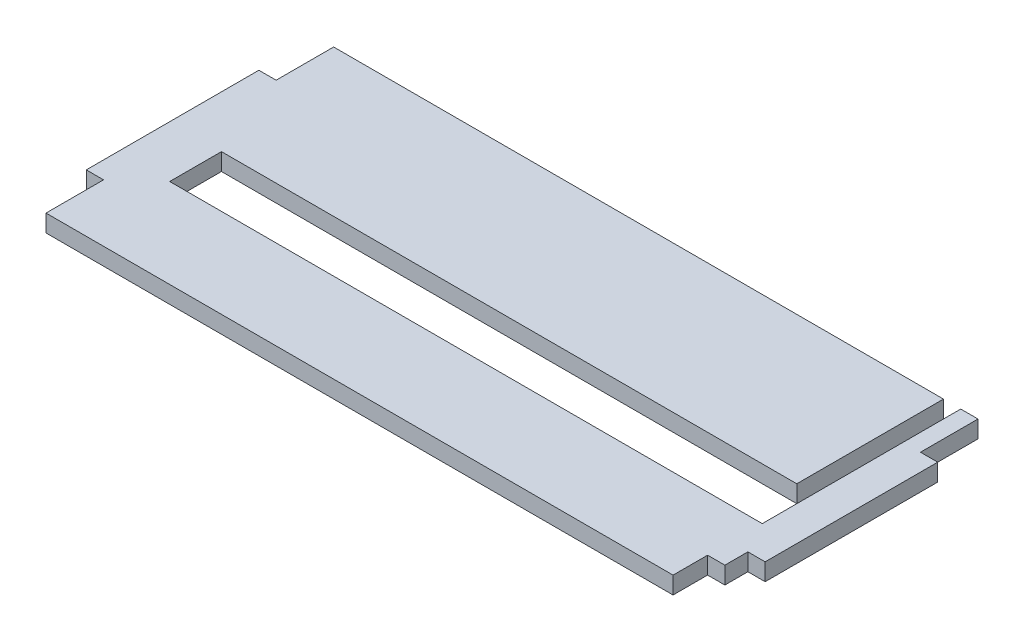
ISO-10303-21;
HEADER;
FILE_DESCRIPTION(('STEP AP214'),'2;1');
FILE_NAME('part.step','',(''),(''),'','','');
FILE_SCHEMA(('AUTOMOTIVE_DESIGN { 1 0 10303 214 1 1 1 1 }'));
ENDSEC;
DATA;
#1=APPLICATION_CONTEXT('core data for automotive mechanical design processes');
#2=APPLICATION_PROTOCOL_DEFINITION('international standard','automotive_design',2000,#1);
#3=PRODUCT_CONTEXT('',#1,'mechanical');
#4=PRODUCT('Part','Part','',(#3));
#5=PRODUCT_RELATED_PRODUCT_CATEGORY('part','',(#4));
#6=PRODUCT_DEFINITION_FORMATION('','',#4);
#7=PRODUCT_DEFINITION_CONTEXT('part definition',#1,'design');
#8=PRODUCT_DEFINITION('design','',#6,#7);
#9=PRODUCT_DEFINITION_SHAPE('','',#8);
#10=(LENGTH_UNIT() NAMED_UNIT(*) SI_UNIT(.MILLI.,.METRE.));
#11=(NAMED_UNIT(*) PLANE_ANGLE_UNIT() SI_UNIT($,.RADIAN.));
#12=(NAMED_UNIT(*) SI_UNIT($,.STERADIAN.) SOLID_ANGLE_UNIT());
#13=UNCERTAINTY_MEASURE_WITH_UNIT(LENGTH_MEASURE(1.E-05),#10,'distance_accuracy_value','');
#14=(GEOMETRIC_REPRESENTATION_CONTEXT(3) GLOBAL_UNCERTAINTY_ASSIGNED_CONTEXT((#13)) GLOBAL_UNIT_ASSIGNED_CONTEXT((#10,
#11,#12)) REPRESENTATION_CONTEXT('',''));
#15=CARTESIAN_POINT('',(0.,0.,0.));
#16=DIRECTION('',(0.,0.,1.));
#17=DIRECTION('',(1.,0.,0.));
#18=AXIS2_PLACEMENT_3D('',#15,#16,#17);
#19=CARTESIAN_POINT('',(0.,0.,99.9999999999988));
#20=DIRECTION('',(0.,0.,-1.));
#21=DIRECTION('',(-1.,0.,0.));
#22=AXIS2_PLACEMENT_3D('',#19,#20,#21);
#23=PLANE('',#22);
#24=DIRECTION('',(0.,1.,0.));
#25=VECTOR('',#24,1.);
#26=CARTESIAN_POINT('',(-9.00000000000162,0.,99.9999999999989));
#27=LINE('',#26,#25);
#28=CARTESIAN_POINT('',(-9.00000000000162,0.,99.9999999999989));
#29=VERTEX_POINT('',#28);
#30=CARTESIAN_POINT('',(-9.00000000000162,3.,99.9999999999989));
#31=VERTEX_POINT('',#30);
#32=EDGE_CURVE('E209',#29,#31,#27,.T.);
#33=ORIENTED_EDGE('',*,*,#32,.F.);
#34=DIRECTION('',(-1.,0.,0.));
#35=VECTOR('',#34,1.);
#36=CARTESIAN_POINT('',(0.,0.,99.9999999999988));
#37=LINE('',#36,#35);
#38=CARTESIAN_POINT('',(-115.000000000005,0.,99.9999999999989));
#39=VERTEX_POINT('',#38);
#40=EDGE_CURVE('E320',#29,#39,#37,.T.);
#41=ORIENTED_EDGE('',*,*,#40,.T.);
#42=DIRECTION('',(0.,1.,0.));
#43=VECTOR('',#42,1.);
#44=CARTESIAN_POINT('',(-115.000000000005,0.,99.9999999999989));
#45=LINE('',#44,#43);
#46=CARTESIAN_POINT('',(-115.000000000005,3.,99.9999999999989));
#47=VERTEX_POINT('',#46);
#48=EDGE_CURVE('E337',#39,#47,#45,.T.);
#49=ORIENTED_EDGE('',*,*,#48,.T.);
#50=DIRECTION('',(-1.,0.,0.));
#51=VECTOR('',#50,1.);
#52=CARTESIAN_POINT('',(-118.000000000002,3.,99.9999999999989));
#53=LINE('',#52,#51);
#54=EDGE_CURVE('E241',#31,#47,#53,.T.);
#55=ORIENTED_EDGE('',*,*,#54,.F.);
#56=EDGE_LOOP('',(#33,#41,#49,#55));
#57=FACE_BOUND('',#56,.T.);
#58=ADVANCED_FACE('F40',(#57),#23,.T.);
#59=CARTESIAN_POINT('',(-1.55431223447522E-12,12.,139.999999999999));
#60=DIRECTION('',(0.,0.,-1.));
#61=DIRECTION('',(-1.,0.,0.));
#62=AXIS2_PLACEMENT_3D('',#59,#60,#61);
#63=PLANE('',#62);
#64=DIRECTION('',(1.,0.,0.));
#65=VECTOR('',#64,1.);
#66=CARTESIAN_POINT('',(-1.55431223447522E-12,3.,139.999999999999));
#67=LINE('',#66,#65);
#68=CARTESIAN_POINT('',(-3.00000000000156,3.,139.999999999999));
#69=VERTEX_POINT('',#68);
#70=CARTESIAN_POINT('',(-1.55431223447522E-12,3.,139.999999999999));
#71=VERTEX_POINT('',#70);
#72=EDGE_CURVE('E257',#69,#71,#67,.T.);
#73=ORIENTED_EDGE('',*,*,#72,.F.);
#74=DIRECTION('',(0.,1.,0.));
#75=VECTOR('',#74,1.);
#76=CARTESIAN_POINT('',(-3.00000000000156,0.,139.999999999999));
#77=LINE('',#76,#75);
#78=CARTESIAN_POINT('',(-3.00000000000156,0.,139.999999999999));
#79=VERTEX_POINT('',#78);
#80=EDGE_CURVE('E321',#79,#69,#77,.T.);
#81=ORIENTED_EDGE('',*,*,#80,.F.);
#82=DIRECTION('',(1.,0.,0.));
#83=VECTOR('',#82,1.);
#84=CARTESIAN_POINT('',(-1.55431223447522E-12,0.,139.999999999999));
#85=LINE('',#84,#83);
#86=CARTESIAN_POINT('',(-1.55431223447522E-12,0.,139.999999999999));
#87=VERTEX_POINT('',#86);
#88=EDGE_CURVE('E342',#79,#87,#85,.T.);
#89=ORIENTED_EDGE('',*,*,#88,.T.);
#90=DIRECTION('',(0.,1.,0.));
#91=VECTOR('',#90,1.);
#92=CARTESIAN_POINT('',(-1.55431223447522E-12,0.,139.999999999999));
#93=LINE('',#92,#91);
#94=EDGE_CURVE('E284',#87,#71,#93,.T.);
#95=ORIENTED_EDGE('',*,*,#94,.T.);
#96=EDGE_LOOP('',(#73,#81,#89,#95));
#97=FACE_BOUND('',#96,.T.);
#98=ADVANCED_FACE('F42',(#97),#63,.F.);
#99=CARTESIAN_POINT('',(-1.60982338570648E-12,12.,109.999999999999));
#100=DIRECTION('',(0.,0.,-1.));
#101=DIRECTION('',(-1.,0.,0.));
#102=AXIS2_PLACEMENT_3D('',#99,#100,#101);
#103=PLANE('',#102);
#104=DIRECTION('',(0.,1.,0.));
#105=VECTOR('',#104,1.);
#106=CARTESIAN_POINT('',(-2.99999999999845,0.,109.999999999999));
#107=LINE('',#106,#105);
#108=CARTESIAN_POINT('',(-2.99999999999845,0.,109.999999999999));
#109=VERTEX_POINT('',#108);
#110=CARTESIAN_POINT('',(-2.99999999999845,3.,109.999999999999));
#111=VERTEX_POINT('',#110);
#112=EDGE_CURVE('E365',#109,#111,#107,.T.);
#113=ORIENTED_EDGE('',*,*,#112,.T.);
#114=DIRECTION('',(1.,0.,0.));
#115=VECTOR('',#114,1.);
#116=CARTESIAN_POINT('',(-1.60982338570648E-12,3.,109.999999999999));
#117=LINE('',#116,#115);
#118=CARTESIAN_POINT('',(-1.55431223447522E-12,3.,109.999999999999));
#119=VERTEX_POINT('',#118);
#120=EDGE_CURVE('E263',#111,#119,#117,.T.);
#121=ORIENTED_EDGE('',*,*,#120,.T.);
#122=DIRECTION('',(0.,1.,0.));
#123=VECTOR('',#122,1.);
#124=CARTESIAN_POINT('',(-3.33066907387547E-13,0.,109.999999999999));
#125=LINE('',#124,#123);
#126=CARTESIAN_POINT('',(-1.55431223447522E-12,0.,109.999999999999));
#127=VERTEX_POINT('',#126);
#128=EDGE_CURVE('E285',#127,#119,#125,.T.);
#129=ORIENTED_EDGE('',*,*,#128,.F.);
#130=DIRECTION('',(1.,0.,0.));
#131=VECTOR('',#130,1.);
#132=CARTESIAN_POINT('',(-1.60982338570648E-12,0.,109.999999999999));
#133=LINE('',#132,#131);
#134=EDGE_CURVE('E375',#109,#127,#133,.T.);
#135=ORIENTED_EDGE('',*,*,#134,.F.);
#136=EDGE_LOOP('',(#113,#121,#129,#135));
#137=FACE_BOUND('',#136,.T.);
#138=ADVANCED_FACE('F443',(#137),#103,.T.);
#139=CARTESIAN_POINT('',(-118.000000000001,12.,109.999999999999));
#140=DIRECTION('',(0.,0.,1.));
#141=DIRECTION('',(1.,0.,0.));
#142=AXIS2_PLACEMENT_3D('',#139,#140,#141);
#143=PLANE('',#142);
#144=DIRECTION('',(-1.,0.,0.));
#145=VECTOR('',#144,1.);
#146=CARTESIAN_POINT('',(-118.000000000001,3.,109.999999999999));
#147=LINE('',#146,#145);
#148=CARTESIAN_POINT('',(-115.000000000005,3.,109.999999999999));
#149=VERTEX_POINT('',#148);
#150=CARTESIAN_POINT('',(-118.000000000002,3.,109.999999999999));
#151=VERTEX_POINT('',#150);
#152=EDGE_CURVE('E271',#149,#151,#147,.T.);
#153=ORIENTED_EDGE('',*,*,#152,.F.);
#154=DIRECTION('',(0.,1.,0.));
#155=VECTOR('',#154,1.);
#156=CARTESIAN_POINT('',(-115.000000000005,0.,109.999999999999));
#157=LINE('',#156,#155);
#158=CARTESIAN_POINT('',(-115.000000000005,0.,109.999999999999));
#159=VERTEX_POINT('',#158);
#160=EDGE_CURVE('E361',#159,#149,#157,.T.);
#161=ORIENTED_EDGE('',*,*,#160,.F.);
#162=DIRECTION('',(-1.,0.,0.));
#163=VECTOR('',#162,1.);
#164=CARTESIAN_POINT('',(-118.000000000001,0.,109.999999999999));
#165=LINE('',#164,#163);
#166=CARTESIAN_POINT('',(-118.000000000001,0.,109.999999999999));
#167=VERTEX_POINT('',#166);
#168=EDGE_CURVE('E379',#159,#167,#165,.T.);
#169=ORIENTED_EDGE('',*,*,#168,.T.);
#170=DIRECTION('',(0.,1.,0.));
#171=VECTOR('',#170,1.);
#172=CARTESIAN_POINT('',(-118.000000000001,0.,109.999999999999));
#173=LINE('',#172,#171);
#174=EDGE_CURVE('E297',#167,#151,#173,.T.);
#175=ORIENTED_EDGE('',*,*,#174,.T.);
#176=EDGE_LOOP('',(#153,#161,#169,#175));
#177=FACE_BOUND('',#176,.T.);
#178=ADVANCED_FACE('F409',(#177),#143,.F.);
#179=CARTESIAN_POINT('',(-118.000000000002,12.,139.999999999999));
#180=DIRECTION('',(0.,0.,1.));
#181=DIRECTION('',(1.,0.,0.));
#182=AXIS2_PLACEMENT_3D('',#179,#180,#181);
#183=PLANE('',#182);
#184=DIRECTION('',(0.,1.,0.));
#185=VECTOR('',#184,1.);
#186=CARTESIAN_POINT('',(-115.000000000002,0.,139.999999999999));
#187=LINE('',#186,#185);
#188=CARTESIAN_POINT('',(-115.000000000002,0.,139.999999999999));
#189=VERTEX_POINT('',#188);
#190=CARTESIAN_POINT('',(-115.000000000002,3.,139.999999999999));
#191=VERTEX_POINT('',#190);
#192=EDGE_CURVE('E336',#189,#191,#187,.T.);
#193=ORIENTED_EDGE('',*,*,#192,.T.);
#194=DIRECTION('',(-1.,0.,0.));
#195=VECTOR('',#194,1.);
#196=CARTESIAN_POINT('',(-118.000000000002,3.,139.999999999999));
#197=LINE('',#196,#195);
#198=CARTESIAN_POINT('',(-118.000000000002,3.,139.999999999999));
#199=VERTEX_POINT('',#198);
#200=EDGE_CURVE('E277',#191,#199,#197,.T.);
#201=ORIENTED_EDGE('',*,*,#200,.T.);
#202=DIRECTION('',(0.,1.,0.));
#203=VECTOR('',#202,1.);
#204=CARTESIAN_POINT('',(-118.000000000002,0.,139.999999999999));
#205=LINE('',#204,#203);
#206=CARTESIAN_POINT('',(-118.000000000001,0.,139.999999999999));
#207=VERTEX_POINT('',#206);
#208=EDGE_CURVE('E296',#207,#199,#205,.T.);
#209=ORIENTED_EDGE('',*,*,#208,.F.);
#210=DIRECTION('',(-1.,0.,0.));
#211=VECTOR('',#210,1.);
#212=CARTESIAN_POINT('',(-118.000000000002,0.,139.999999999999));
#213=LINE('',#212,#211);
#214=EDGE_CURVE('E383',#189,#207,#213,.T.);
#215=ORIENTED_EDGE('',*,*,#214,.F.);
#216=EDGE_LOOP('',(#193,#201,#209,#215));
#217=FACE_BOUND('',#216,.T.);
#218=ADVANCED_FACE('F402',(#217),#183,.T.);
#219=CARTESIAN_POINT('',(-1.60982338570648E-12,12.,149.999999999999));
#220=DIRECTION('',(0.,0.,1.));
#221=DIRECTION('',(1.,0.,0.));
#222=AXIS2_PLACEMENT_3D('',#219,#220,#221);
#223=PLANE('',#222);
#224=DIRECTION('',(0.,1.,0.));
#225=VECTOR('',#224,1.);
#226=CARTESIAN_POINT('',(-6.00197015274362,0.,149.999999999999));
#227=LINE('',#226,#225);
#228=CARTESIAN_POINT('',(-6.00197015274362,0.,149.999999999999));
#229=VERTEX_POINT('',#228);
#230=CARTESIAN_POINT('',(-6.00197015274362,3.,149.999999999999));
#231=VERTEX_POINT('',#230);
#232=EDGE_CURVE('E325',#229,#231,#227,.T.);
#233=ORIENTED_EDGE('',*,*,#232,.T.);
#234=DIRECTION('',(1.,0.,0.));
#235=VECTOR('',#234,1.);
#236=CARTESIAN_POINT('',(-118.000000000002,3.,149.999999999999));
#237=LINE('',#236,#235);
#238=CARTESIAN_POINT('',(-115.000000000002,3.,149.999999999999));
#239=VERTEX_POINT('',#238);
#240=EDGE_CURVE('E238',#239,#231,#237,.T.);
#241=ORIENTED_EDGE('',*,*,#240,.F.);
#242=DIRECTION('',(0.,1.,0.));
#243=VECTOR('',#242,1.);
#244=CARTESIAN_POINT('',(-115.000000000002,0.,149.999999999999));
#245=LINE('',#244,#243);
#246=CARTESIAN_POINT('',(-115.000000000002,0.,149.999999999999));
#247=VERTEX_POINT('',#246);
#248=EDGE_CURVE('E338',#247,#239,#245,.T.);
#249=ORIENTED_EDGE('',*,*,#248,.F.);
#250=DIRECTION('',(-1.,0.,0.));
#251=VECTOR('',#250,1.);
#252=CARTESIAN_POINT('',(-1.60982338570648E-12,0.,149.999999999999));
#253=LINE('',#252,#251);
#254=EDGE_CURVE('E49',#229,#247,#253,.T.);
#255=ORIENTED_EDGE('',*,*,#254,.F.);
#256=EDGE_LOOP('',(#233,#241,#249,#255));
#257=FACE_BOUND('',#256,.T.);
#258=ADVANCED_FACE('F395',(#257),#223,.T.);
#259=CARTESIAN_POINT('',(-115.000000000002,0.,0.));
#260=DIRECTION('',(1.,0.,0.));
#261=DIRECTION('',(0.,0.,-1.));
#262=AXIS2_PLACEMENT_3D('',#259,#260,#261);
#263=PLANE('',#262);
#264=DIRECTION('',(0.,0.,1.));
#265=VECTOR('',#264,1.);
#266=CARTESIAN_POINT('',(-115.000000000002,3.,0.));
#267=LINE('',#266,#265);
#268=EDGE_CURVE('E274',#191,#239,#267,.T.);
#269=ORIENTED_EDGE('',*,*,#268,.F.);
#270=ORIENTED_EDGE('',*,*,#192,.F.);
#271=DIRECTION('',(0.,0.,-1.));
#272=VECTOR('',#271,1.);
#273=CARTESIAN_POINT('',(-115.000000000002,0.,0.));
#274=LINE('',#273,#272);
#275=EDGE_CURVE('E332',#247,#189,#274,.T.);
#276=ORIENTED_EDGE('',*,*,#275,.F.);
#277=ORIENTED_EDGE('',*,*,#248,.T.);
#278=EDGE_LOOP('',(#269,#270,#276,#277));
#279=FACE_BOUND('',#278,.T.);
#280=ADVANCED_FACE('F399',(#279),#263,.F.);
#281=DIRECTION('',(0.,1.,0.));
#282=VECTOR('',#281,1.);
#283=CARTESIAN_POINT('',(-6.00000000000162,0.,99.9999999999989));
#284=LINE('',#283,#282);
#285=CARTESIAN_POINT('',(-6.00000000000162,0.,99.9999999999989));
#286=VERTEX_POINT('',#285);
#287=CARTESIAN_POINT('',(-6.00000000000162,3.,99.9999999999989));
#288=VERTEX_POINT('',#287);
#289=EDGE_CURVE('E198',#286,#288,#284,.T.);
#290=ORIENTED_EDGE('',*,*,#289,.T.);
#291=CARTESIAN_POINT('',(-2.9999999999985,3.,99.9999999999989));
#292=VERTEX_POINT('',#291);
#293=EDGE_CURVE('E242',#292,#288,#53,.T.);
#294=ORIENTED_EDGE('',*,*,#293,.F.);
#295=DIRECTION('',(0.,1.,0.));
#296=VECTOR('',#295,1.);
#297=CARTESIAN_POINT('',(-2.9999999999985,0.,99.9999999999989));
#298=LINE('',#297,#296);
#299=CARTESIAN_POINT('',(-2.9999999999985,0.,99.9999999999989));
#300=VERTEX_POINT('',#299);
#301=EDGE_CURVE('E357',#300,#292,#298,.T.);
#302=ORIENTED_EDGE('',*,*,#301,.F.);
#303=EDGE_CURVE('E346',#300,#286,#37,.T.);
#304=ORIENTED_EDGE('',*,*,#303,.T.);
#305=EDGE_LOOP('',(#290,#294,#302,#304));
#306=FACE_BOUND('',#305,.T.);
#307=ADVANCED_FACE('F439',(#306),#23,.T.);
#308=CARTESIAN_POINT('',(-115.000000000005,0.,0.));
#309=DIRECTION('',(-1.,0.,0.));
#310=DIRECTION('',(0.,0.,1.));
#311=AXIS2_PLACEMENT_3D('',#308,#309,#310);
#312=PLANE('',#311);
#313=ORIENTED_EDGE('',*,*,#160,.T.);
#314=DIRECTION('',(0.,0.,-1.));
#315=VECTOR('',#314,1.);
#316=CARTESIAN_POINT('',(-115.000000000005,3.,0.));
#317=LINE('',#316,#315);
#318=EDGE_CURVE('E267',#149,#47,#317,.T.);
#319=ORIENTED_EDGE('',*,*,#318,.T.);
#320=ORIENTED_EDGE('',*,*,#48,.F.);
#321=DIRECTION('',(0.,0.,1.));
#322=VECTOR('',#321,1.);
#323=CARTESIAN_POINT('',(-115.000000000005,0.,0.));
#324=LINE('',#323,#322);
#325=EDGE_CURVE('E353',#39,#159,#324,.T.);
#326=ORIENTED_EDGE('',*,*,#325,.T.);
#327=EDGE_LOOP('',(#313,#319,#320,#326));
#328=FACE_BOUND('',#327,.T.);
#329=ADVANCED_FACE('F411',(#328),#312,.T.);
#330=CARTESIAN_POINT('',(-2.99999999999845,0.,0.));
#331=DIRECTION('',(-1.,0.,0.));
#332=DIRECTION('',(0.,0.,1.));
#333=AXIS2_PLACEMENT_3D('',#330,#331,#332);
#334=PLANE('',#333);
#335=DIRECTION('',(0.,0.,-1.));
#336=VECTOR('',#335,1.);
#337=CARTESIAN_POINT('',(-2.99999999999845,3.,0.));
#338=LINE('',#337,#336);
#339=EDGE_CURVE('E260',#111,#292,#338,.T.);
#340=ORIENTED_EDGE('',*,*,#339,.F.);
#341=ORIENTED_EDGE('',*,*,#112,.F.);
#342=DIRECTION('',(0.,0.,1.));
#343=VECTOR('',#342,1.);
#344=CARTESIAN_POINT('',(-2.99999999999845,0.,0.));
#345=LINE('',#344,#343);
#346=EDGE_CURVE('E349',#300,#109,#345,.T.);
#347=ORIENTED_EDGE('',*,*,#346,.F.);
#348=ORIENTED_EDGE('',*,*,#301,.T.);
#349=EDGE_LOOP('',(#340,#341,#347,#348));
#350=FACE_BOUND('',#349,.T.);
#351=ADVANCED_FACE('F453',(#350),#334,.F.);
#352=CARTESIAN_POINT('',(0.,0.,143.999999999999));
#353=DIRECTION('',(0.,0.,1.));
#354=DIRECTION('',(1.,0.,0.));
#355=AXIS2_PLACEMENT_3D('',#352,#353,#354);
#356=PLANE('',#355);
#357=DIRECTION('',(0.,1.,0.));
#358=VECTOR('',#357,1.);
#359=CARTESIAN_POINT('',(-3.00000000000156,0.,143.999999999999));
#360=LINE('',#359,#358);
#361=CARTESIAN_POINT('',(-3.00000000000156,0.,143.999999999999));
#362=VERTEX_POINT('',#361);
#363=CARTESIAN_POINT('',(-3.00000000000156,3.,143.999999999999));
#364=VERTEX_POINT('',#363);
#365=EDGE_CURVE('E316',#362,#364,#360,.T.);
#366=ORIENTED_EDGE('',*,*,#365,.T.);
#367=DIRECTION('',(-1.,0.,0.));
#368=VECTOR('',#367,1.);
#369=CARTESIAN_POINT('',(0.,3.,143.999999999999));
#370=LINE('',#369,#368);
#371=CARTESIAN_POINT('',(-6.00197015274351,3.,143.999999999999));
#372=VERTEX_POINT('',#371);
#373=EDGE_CURVE('E249',#364,#372,#370,.T.);
#374=ORIENTED_EDGE('',*,*,#373,.T.);
#375=DIRECTION('',(0.,1.,0.));
#376=VECTOR('',#375,1.);
#377=CARTESIAN_POINT('',(-6.00197015274351,0.,143.999999999999));
#378=LINE('',#377,#376);
#379=CARTESIAN_POINT('',(-6.00197015274351,0.,143.999999999999));
#380=VERTEX_POINT('',#379);
#381=EDGE_CURVE('E315',#380,#372,#378,.T.);
#382=ORIENTED_EDGE('',*,*,#381,.F.);
#383=DIRECTION('',(1.,0.,0.));
#384=VECTOR('',#383,1.);
#385=CARTESIAN_POINT('',(0.,0.,143.999999999999));
#386=LINE('',#385,#384);
#387=EDGE_CURVE('E301',#380,#362,#386,.T.);
#388=ORIENTED_EDGE('',*,*,#387,.T.);
#389=EDGE_LOOP('',(#366,#374,#382,#388));
#390=FACE_BOUND('',#389,.T.);
#391=ADVANCED_FACE('F472',(#390),#356,.T.);
#392=CARTESIAN_POINT('',(-3.00000000000156,0.,0.));
#393=DIRECTION('',(1.,0.,0.));
#394=DIRECTION('',(0.,0.,-1.));
#395=AXIS2_PLACEMENT_3D('',#392,#393,#394);
#396=PLANE('',#395);
#397=ORIENTED_EDGE('',*,*,#80,.T.);
#398=DIRECTION('',(0.,0.,1.));
#399=VECTOR('',#398,1.);
#400=CARTESIAN_POINT('',(-3.00000000000156,3.,0.));
#401=LINE('',#400,#399);
#402=EDGE_CURVE('E253',#69,#364,#401,.T.);
#403=ORIENTED_EDGE('',*,*,#402,.T.);
#404=ORIENTED_EDGE('',*,*,#365,.F.);
#405=DIRECTION('',(0.,0.,-1.));
#406=VECTOR('',#405,1.);
#407=CARTESIAN_POINT('',(-3.00000000000156,0.,0.));
#408=LINE('',#407,#406);
#409=EDGE_CURVE('E311',#362,#79,#408,.T.);
#410=ORIENTED_EDGE('',*,*,#409,.T.);
#411=EDGE_LOOP('',(#397,#403,#404,#410));
#412=FACE_BOUND('',#411,.T.);
#413=ADVANCED_FACE('F469',(#412),#396,.T.);
#414=CARTESIAN_POINT('',(-6.00197015274356,0.,0.));
#415=DIRECTION('',(-1.,0.,0.));
#416=DIRECTION('',(0.,0.,1.));
#417=AXIS2_PLACEMENT_3D('',#414,#415,#416);
#418=PLANE('',#417);
#419=DIRECTION('',(0.,0.,-1.));
#420=VECTOR('',#419,1.);
#421=CARTESIAN_POINT('',(-6.00197015274356,3.,0.));
#422=LINE('',#421,#420);
#423=EDGE_CURVE('E246',#231,#372,#422,.T.);
#424=ORIENTED_EDGE('',*,*,#423,.F.);
#425=ORIENTED_EDGE('',*,*,#232,.F.);
#426=DIRECTION('',(0.,0.,1.));
#427=VECTOR('',#426,1.);
#428=CARTESIAN_POINT('',(-6.00197015274356,0.,0.));
#429=LINE('',#428,#427);
#430=EDGE_CURVE('E307',#380,#229,#429,.T.);
#431=ORIENTED_EDGE('',*,*,#430,.F.);
#432=ORIENTED_EDGE('',*,*,#381,.T.);
#433=EDGE_LOOP('',(#424,#425,#431,#432));
#434=FACE_BOUND('',#433,.T.);
#435=ADVANCED_FACE('F475',(#434),#418,.F.);
#436=CARTESIAN_POINT('',(-118.000000000002,0.,0.));
#437=DIRECTION('',(1.,0.,0.));
#438=DIRECTION('',(0.,0.,-1.));
#439=AXIS2_PLACEMENT_3D('',#436,#437,#438);
#440=PLANE('',#439);
#441=DIRECTION('',(0.,0.,1.));
#442=VECTOR('',#441,1.);
#443=CARTESIAN_POINT('',(-118.000000000002,3.,99.9999999999989));
#444=LINE('',#443,#442);
#445=EDGE_CURVE('E230',#151,#199,#444,.T.);
#446=ORIENTED_EDGE('',*,*,#445,.F.);
#447=ORIENTED_EDGE('',*,*,#174,.F.);
#448=DIRECTION('',(0.,0.,-1.));
#449=VECTOR('',#448,1.);
#450=CARTESIAN_POINT('',(-118.000000000002,0.,0.));
#451=LINE('',#450,#449);
#452=EDGE_CURVE('E289',#207,#167,#451,.T.);
#453=ORIENTED_EDGE('',*,*,#452,.F.);
#454=ORIENTED_EDGE('',*,*,#208,.T.);
#455=EDGE_LOOP('',(#446,#447,#453,#454));
#456=FACE_BOUND('',#455,.T.);
#457=ADVANCED_FACE('F477',(#456),#440,.F.);
#458=CARTESIAN_POINT('',(0.,0.,0.));
#459=DIRECTION('',(1.,0.,0.));
#460=DIRECTION('',(0.,0.,-1.));
#461=AXIS2_PLACEMENT_3D('',#458,#459,#460);
#462=PLANE('',#461);
#463=ORIENTED_EDGE('',*,*,#128,.T.);
#464=DIRECTION('',(0.,0.,1.));
#465=VECTOR('',#464,1.);
#466=CARTESIAN_POINT('',(0.,3.,0.));
#467=LINE('',#466,#465);
#468=EDGE_CURVE('E11',#119,#71,#467,.T.);
#469=ORIENTED_EDGE('',*,*,#468,.T.);
#470=ORIENTED_EDGE('',*,*,#94,.F.);
#471=DIRECTION('',(0.,0.,-1.));
#472=VECTOR('',#471,1.);
#473=CARTESIAN_POINT('',(0.,0.,0.));
#474=LINE('',#473,#472);
#475=EDGE_CURVE('E281',#87,#127,#474,.T.);
#476=ORIENTED_EDGE('',*,*,#475,.T.);
#477=EDGE_LOOP('',(#463,#469,#470,#476));
#478=FACE_BOUND('',#477,.T.);
#479=ADVANCED_FACE('F479',(#478),#462,.T.);
#480=CARTESIAN_POINT('',(0.,0.,0.));
#481=DIRECTION('',(0.,-1.,0.));
#482=DIRECTION('',(0.,0.,-1.));
#483=AXIS2_PLACEMENT_3D('',#480,#481,#482);
#484=PLANE('',#483);
#485=DIRECTION('',(0.,0.,1.));
#486=VECTOR('',#485,1.);
#487=CARTESIAN_POINT('',(-9.00000000000162,0.,134.499999999999));
#488=LINE('',#487,#486);
#489=CARTESIAN_POINT('',(-9.00000000000162,0.,125.499999999999));
#490=VERTEX_POINT('',#489);
#491=EDGE_CURVE('E202',#29,#490,#488,.T.);
#492=ORIENTED_EDGE('',*,*,#491,.T.);
#493=DIRECTION('',(-1.,0.,0.));
#494=VECTOR('',#493,1.);
#495=CARTESIAN_POINT('',(-109.000000000002,0.,125.499999999999));
#496=LINE('',#495,#494);
#497=CARTESIAN_POINT('',(-109.000000000002,0.,125.499999999999));
#498=VERTEX_POINT('',#497);
#499=EDGE_CURVE('E213',#490,#498,#496,.T.);
#500=ORIENTED_EDGE('',*,*,#499,.T.);
#501=DIRECTION('',(0.,0.,1.));
#502=VECTOR('',#501,1.);
#503=CARTESIAN_POINT('',(-109.000000000002,0.,125.499999999999));
#504=LINE('',#503,#502);
#505=CARTESIAN_POINT('',(-109.000000000002,0.,134.499999999999));
#506=VERTEX_POINT('',#505);
#507=EDGE_CURVE('E56',#498,#506,#504,.T.);
#508=ORIENTED_EDGE('',*,*,#507,.T.);
#509=DIRECTION('',(1.,0.,0.));
#510=VECTOR('',#509,1.);
#511=CARTESIAN_POINT('',(-109.000000000002,0.,134.499999999999));
#512=LINE('',#511,#510);
#513=CARTESIAN_POINT('',(-6.00000000000162,0.,134.499999999999));
#514=VERTEX_POINT('',#513);
#515=EDGE_CURVE('E178',#506,#514,#512,.T.);
#516=ORIENTED_EDGE('',*,*,#515,.T.);
#517=DIRECTION('',(0.,0.,-1.));
#518=VECTOR('',#517,1.);
#519=CARTESIAN_POINT('',(-6.00000000000162,0.,134.499999999999));
#520=LINE('',#519,#518);
#521=EDGE_CURVE('E184',#514,#286,#520,.T.);
#522=ORIENTED_EDGE('',*,*,#521,.T.);
#523=ORIENTED_EDGE('',*,*,#303,.F.);
#524=ORIENTED_EDGE('',*,*,#346,.T.);
#525=ORIENTED_EDGE('',*,*,#134,.T.);
#526=ORIENTED_EDGE('',*,*,#475,.F.);
#527=ORIENTED_EDGE('',*,*,#88,.F.);
#528=ORIENTED_EDGE('',*,*,#409,.F.);
#529=ORIENTED_EDGE('',*,*,#387,.F.);
#530=ORIENTED_EDGE('',*,*,#430,.T.);
#531=ORIENTED_EDGE('',*,*,#254,.T.);
#532=ORIENTED_EDGE('',*,*,#275,.T.);
#533=ORIENTED_EDGE('',*,*,#214,.T.);
#534=ORIENTED_EDGE('',*,*,#452,.T.);
#535=ORIENTED_EDGE('',*,*,#168,.F.);
#536=ORIENTED_EDGE('',*,*,#325,.F.);
#537=ORIENTED_EDGE('',*,*,#40,.F.);
#538=EDGE_LOOP('',(#492,#500,#508,#516,#522,#523,#524,#525,#526,#527,#528,#529,#530,#531,#532,
#533,#534,#535,#536,#537));
#539=FACE_BOUND('',#538,.T.);
#540=ADVANCED_FACE('F181',(#539),#484,.T.);
#541=CARTESIAN_POINT('',(0.,3.,0.));
#542=DIRECTION('',(0.,1.,0.));
#543=DIRECTION('',(0.,0.,1.));
#544=AXIS2_PLACEMENT_3D('',#541,#542,#543);
#545=PLANE('',#544);
#546=DIRECTION('',(0.,0.,1.));
#547=VECTOR('',#546,1.);
#548=CARTESIAN_POINT('',(-9.00000000000162,3.,134.499999999999));
#549=LINE('',#548,#547);
#550=CARTESIAN_POINT('',(-9.00000000000156,3.,125.499999999999));
#551=VERTEX_POINT('',#550);
#552=EDGE_CURVE('E64',#31,#551,#549,.T.);
#553=ORIENTED_EDGE('',*,*,#552,.F.);
#554=ORIENTED_EDGE('',*,*,#54,.T.);
#555=ORIENTED_EDGE('',*,*,#318,.F.);
#556=ORIENTED_EDGE('',*,*,#152,.T.);
#557=ORIENTED_EDGE('',*,*,#445,.T.);
#558=ORIENTED_EDGE('',*,*,#200,.F.);
#559=ORIENTED_EDGE('',*,*,#268,.T.);
#560=ORIENTED_EDGE('',*,*,#240,.T.);
#561=ORIENTED_EDGE('',*,*,#423,.T.);
#562=ORIENTED_EDGE('',*,*,#373,.F.);
#563=ORIENTED_EDGE('',*,*,#402,.F.);
#564=ORIENTED_EDGE('',*,*,#72,.T.);
#565=ORIENTED_EDGE('',*,*,#468,.F.);
#566=ORIENTED_EDGE('',*,*,#120,.F.);
#567=ORIENTED_EDGE('',*,*,#339,.T.);
#568=ORIENTED_EDGE('',*,*,#293,.T.);
#569=DIRECTION('',(0.,0.,-1.));
#570=VECTOR('',#569,1.);
#571=CARTESIAN_POINT('',(-6.00000000000162,3.,134.499999999999));
#572=LINE('',#571,#570);
#573=CARTESIAN_POINT('',(-6.00000000000162,3.,134.499999999999));
#574=VERTEX_POINT('',#573);
#575=EDGE_CURVE('E204',#574,#288,#572,.T.);
#576=ORIENTED_EDGE('',*,*,#575,.F.);
#577=DIRECTION('',(1.,0.,0.));
#578=VECTOR('',#577,1.);
#579=CARTESIAN_POINT('',(-109.000000000002,3.,134.499999999999));
#580=LINE('',#579,#578);
#581=CARTESIAN_POINT('',(-109.000000000002,3.,134.499999999999));
#582=VERTEX_POINT('',#581);
#583=EDGE_CURVE('E195',#582,#574,#580,.T.);
#584=ORIENTED_EDGE('',*,*,#583,.F.);
#585=DIRECTION('',(0.,0.,1.));
#586=VECTOR('',#585,1.);
#587=CARTESIAN_POINT('',(-109.000000000002,3.,125.499999999999));
#588=LINE('',#587,#586);
#589=CARTESIAN_POINT('',(-109.000000000002,3.,125.499999999999));
#590=VERTEX_POINT('',#589);
#591=EDGE_CURVE('E221',#590,#582,#588,.T.);
#592=ORIENTED_EDGE('',*,*,#591,.F.);
#593=DIRECTION('',(-1.,0.,0.));
#594=VECTOR('',#593,1.);
#595=CARTESIAN_POINT('',(-109.000000000002,3.,125.499999999999));
#596=LINE('',#595,#594);
#597=EDGE_CURVE('E211',#551,#590,#596,.T.);
#598=ORIENTED_EDGE('',*,*,#597,.F.);
#599=EDGE_LOOP('',(#553,#554,#555,#556,#557,#558,#559,#560,#561,#562,#563,#564,#565,#566,#567,
#568,#576,#584,#592,#598));
#600=FACE_BOUND('',#599,.T.);
#601=ADVANCED_FACE('F422',(#600),#545,.T.);
#602=CARTESIAN_POINT('',(-109.000000000002,0.,134.499999999999));
#603=DIRECTION('',(0.,0.,1.));
#604=DIRECTION('',(1.,0.,0.));
#605=AXIS2_PLACEMENT_3D('',#602,#603,#604);
#606=PLANE('',#605);
#607=ORIENTED_EDGE('',*,*,#583,.T.);
#608=DIRECTION('',(0.,1.,0.));
#609=VECTOR('',#608,1.);
#610=CARTESIAN_POINT('',(-6.00000000000162,0.,134.499999999999));
#611=LINE('',#610,#609);
#612=EDGE_CURVE('E192',#514,#574,#611,.T.);
#613=ORIENTED_EDGE('',*,*,#612,.F.);
#614=ORIENTED_EDGE('',*,*,#515,.F.);
#615=DIRECTION('',(0.,1.,0.));
#616=VECTOR('',#615,1.);
#617=CARTESIAN_POINT('',(-109.000000000002,0.,134.499999999999));
#618=LINE('',#617,#616);
#619=EDGE_CURVE('E227',#506,#582,#618,.T.);
#620=ORIENTED_EDGE('',*,*,#619,.T.);
#621=EDGE_LOOP('',(#607,#613,#614,#620));
#622=FACE_BOUND('',#621,.T.);
#623=ADVANCED_FACE('F193',(#622),#606,.F.);
#624=CARTESIAN_POINT('',(-109.000000000002,0.,125.499999999999));
#625=DIRECTION('',(-1.,0.,0.));
#626=DIRECTION('',(0.,0.,1.));
#627=AXIS2_PLACEMENT_3D('',#624,#625,#626);
#628=PLANE('',#627);
#629=ORIENTED_EDGE('',*,*,#591,.T.);
#630=ORIENTED_EDGE('',*,*,#619,.F.);
#631=ORIENTED_EDGE('',*,*,#507,.F.);
#632=DIRECTION('',(0.,1.,0.));
#633=VECTOR('',#632,1.);
#634=CARTESIAN_POINT('',(-109.000000000002,0.,125.499999999999));
#635=LINE('',#634,#633);
#636=EDGE_CURVE('E231',#498,#590,#635,.T.);
#637=ORIENTED_EDGE('',*,*,#636,.T.);
#638=EDGE_LOOP('',(#629,#630,#631,#637));
#639=FACE_BOUND('',#638,.T.);
#640=ADVANCED_FACE('F428',(#639),#628,.F.);
#641=CARTESIAN_POINT('',(-109.000000000002,0.,125.499999999999));
#642=DIRECTION('',(0.,0.,-1.));
#643=DIRECTION('',(-1.,0.,0.));
#644=AXIS2_PLACEMENT_3D('',#641,#642,#643);
#645=PLANE('',#644);
#646=ORIENTED_EDGE('',*,*,#597,.T.);
#647=ORIENTED_EDGE('',*,*,#636,.F.);
#648=ORIENTED_EDGE('',*,*,#499,.F.);
#649=DIRECTION('',(0.,1.,0.));
#650=VECTOR('',#649,1.);
#651=CARTESIAN_POINT('',(-9.00000000000156,0.,125.499999999999));
#652=LINE('',#651,#650);
#653=EDGE_CURVE('E189',#490,#551,#652,.T.);
#654=ORIENTED_EDGE('',*,*,#653,.T.);
#655=EDGE_LOOP('',(#646,#647,#648,#654));
#656=FACE_BOUND('',#655,.T.);
#657=ADVANCED_FACE('F426',(#656),#645,.F.);
#658=CARTESIAN_POINT('',(-9.00000000000162,0.,134.499999999999));
#659=DIRECTION('',(-1.,0.,0.));
#660=DIRECTION('',(0.,0.,1.));
#661=AXIS2_PLACEMENT_3D('',#658,#659,#660);
#662=PLANE('',#661);
#663=ORIENTED_EDGE('',*,*,#491,.F.);
#664=ORIENTED_EDGE('',*,*,#32,.T.);
#665=ORIENTED_EDGE('',*,*,#552,.T.);
#666=ORIENTED_EDGE('',*,*,#653,.F.);
#667=EDGE_LOOP('',(#663,#664,#665,#666));
#668=FACE_BOUND('',#667,.T.);
#669=ADVANCED_FACE('F424',(#668),#662,.F.);
#670=CARTESIAN_POINT('',(-6.00000000000162,0.,134.499999999999));
#671=DIRECTION('',(1.,0.,0.));
#672=DIRECTION('',(0.,0.,-1.));
#673=AXIS2_PLACEMENT_3D('',#670,#671,#672);
#674=PLANE('',#673);
#675=ORIENTED_EDGE('',*,*,#575,.T.);
#676=ORIENTED_EDGE('',*,*,#289,.F.);
#677=ORIENTED_EDGE('',*,*,#521,.F.);
#678=ORIENTED_EDGE('',*,*,#612,.T.);
#679=EDGE_LOOP('',(#675,#676,#677,#678));
#680=FACE_BOUND('',#679,.T.);
#681=ADVANCED_FACE('F200',(#680),#674,.F.);
#682=CLOSED_SHELL('',(#58,#98,#138,#178,#218,#258,#280,#307,#329,#351,#391,#413,#435,#457,#479,
#540,#601,#623,#640,#657,#669,#681));
#683=MANIFOLD_SOLID_BREP('B2',#682);
#684=ADVANCED_BREP_SHAPE_REPRESENTATION('',(#18,#683),#14);
#685=SHAPE_DEFINITION_REPRESENTATION(#9,#684);
ENDSEC;
END-ISO-10303-21;
